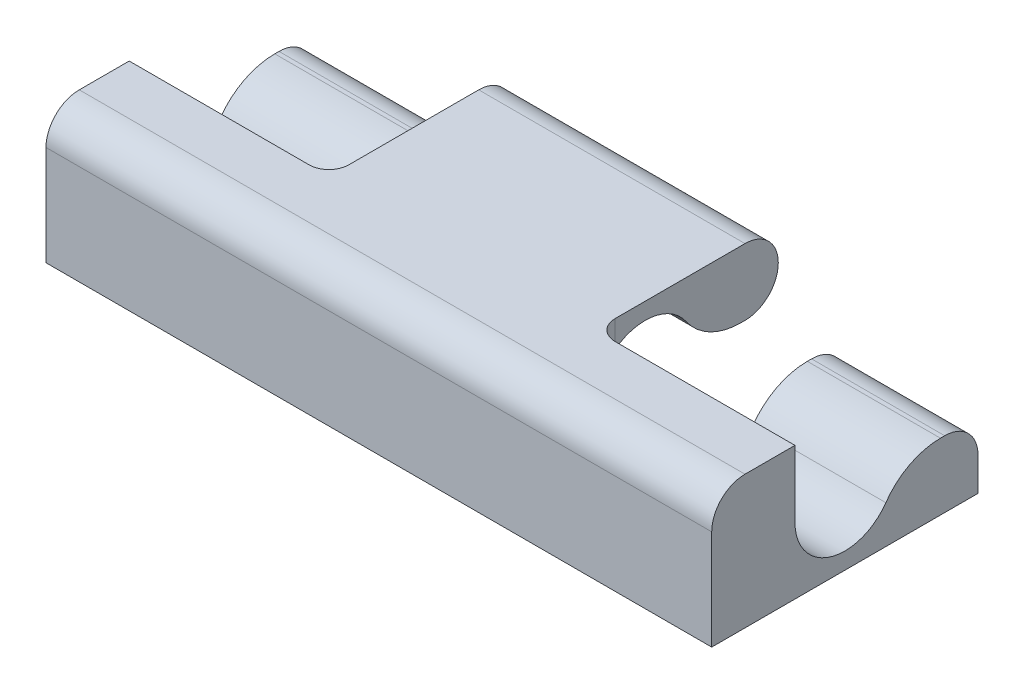
ISO-10303-21;
HEADER;
FILE_DESCRIPTION(('STEP AP214'),'2;1');
FILE_NAME('part.step','',(''),(''),'','','');
FILE_SCHEMA(('AUTOMOTIVE_DESIGN { 1 0 10303 214 1 1 1 1 }'));
ENDSEC;
DATA;
#1=APPLICATION_CONTEXT('core data for automotive mechanical design processes');
#2=APPLICATION_PROTOCOL_DEFINITION('international standard','automotive_design',2000,#1);
#3=PRODUCT_CONTEXT('',#1,'mechanical');
#4=PRODUCT('Part','Part','',(#3));
#5=PRODUCT_RELATED_PRODUCT_CATEGORY('part','',(#4));
#6=PRODUCT_DEFINITION_FORMATION('','',#4);
#7=PRODUCT_DEFINITION_CONTEXT('part definition',#1,'design');
#8=PRODUCT_DEFINITION('design','',#6,#7);
#9=PRODUCT_DEFINITION_SHAPE('','',#8);
#10=(LENGTH_UNIT() NAMED_UNIT(*) SI_UNIT(.MILLI.,.METRE.));
#11=(NAMED_UNIT(*) PLANE_ANGLE_UNIT() SI_UNIT($,.RADIAN.));
#12=(NAMED_UNIT(*) SI_UNIT($,.STERADIAN.) SOLID_ANGLE_UNIT());
#13=UNCERTAINTY_MEASURE_WITH_UNIT(LENGTH_MEASURE(1.E-05),#10,'distance_accuracy_value','');
#14=(GEOMETRIC_REPRESENTATION_CONTEXT(3) GLOBAL_UNCERTAINTY_ASSIGNED_CONTEXT((#13)) GLOBAL_UNIT_ASSIGNED_CONTEXT((#10,
#11,#12)) REPRESENTATION_CONTEXT('',''));
#15=CARTESIAN_POINT('',(0.,0.,0.));
#16=DIRECTION('',(0.,0.,1.));
#17=DIRECTION('',(1.,0.,0.));
#18=AXIS2_PLACEMENT_3D('',#15,#16,#17);
#19=CARTESIAN_POINT('',(-5.,2.,-2.));
#20=DIRECTION('',(0.,0.,1.));
#21=DIRECTION('',(1.,0.,0.));
#22=AXIS2_PLACEMENT_3D('',#19,#20,#21);
#23=PLANE('',#22);
#24=DIRECTION('',(0.,-1.,0.));
#25=VECTOR('',#24,1.);
#26=CARTESIAN_POINT('',(3.,1.,-2.));
#27=LINE('',#26,#25);
#28=CARTESIAN_POINT('',(3.,0.5,-2.));
#29=VERTEX_POINT('',#28);
#30=CARTESIAN_POINT('',(3.,0.,-2.));
#31=VERTEX_POINT('',#30);
#32=EDGE_CURVE('E242',#29,#31,#27,.T.);
#33=ORIENTED_EDGE('',*,*,#32,.F.);
#34=DIRECTION('',(1.,0.,0.));
#35=VECTOR('',#34,1.);
#36=CARTESIAN_POINT('',(5.,0.5,-2.));
#37=LINE('',#36,#35);
#38=CARTESIAN_POINT('',(5.,0.5,-2.));
#39=VERTEX_POINT('',#38);
#40=EDGE_CURVE('E333',#29,#39,#37,.T.);
#41=ORIENTED_EDGE('',*,*,#40,.T.);
#42=DIRECTION('',(0.,-1.,0.));
#43=VECTOR('',#42,1.);
#44=CARTESIAN_POINT('',(5.,2.,-2.));
#45=LINE('',#44,#43);
#46=CARTESIAN_POINT('',(5.,0.,-2.));
#47=VERTEX_POINT('',#46);
#48=EDGE_CURVE('E253',#39,#47,#45,.T.);
#49=ORIENTED_EDGE('',*,*,#48,.T.);
#50=DIRECTION('',(-1.,0.,0.));
#51=VECTOR('',#50,1.);
#52=CARTESIAN_POINT('',(-5.,0.,-2.));
#53=LINE('',#52,#51);
#54=EDGE_CURVE('E234',#47,#31,#53,.T.);
#55=ORIENTED_EDGE('',*,*,#54,.T.);
#56=EDGE_LOOP('',(#33,#41,#49,#55));
#57=FACE_BOUND('',#56,.T.);
#58=ADVANCED_FACE('F39',(#57),#23,.F.);
#59=CARTESIAN_POINT('',(-5.,1.,0.));
#60=DIRECTION('',(1.,0.,0.));
#61=DIRECTION('',(0.,0.,-1.));
#62=AXIS2_PLACEMENT_3D('',#59,#60,#61);
#63=CYLINDRICAL_SURFACE('',#62,0.75);
#64=CARTESIAN_POINT('',(5.,1.,0.));
#65=DIRECTION('',(1.,0.,0.));
#66=DIRECTION('',(0.,0.,-1.));
#67=AXIS2_PLACEMENT_3D('',#64,#65,#66);
#68=CIRCLE('',#67,0.75);
#69=CARTESIAN_POINT('',(5.,1.,0.75));
#70=VERTEX_POINT('',#69);
#71=CARTESIAN_POINT('',(5.,0.571428571428571,-0.615488854986217));
#72=VERTEX_POINT('',#71);
#73=EDGE_CURVE('E469',#70,#72,#68,.T.);
#74=ORIENTED_EDGE('',*,*,#73,.T.);
#75=DIRECTION('',(1.,0.,0.));
#76=VECTOR('',#75,1.);
#77=CARTESIAN_POINT('',(-5.,0.571428571428571,-0.615488854986217));
#78=LINE('',#77,#76);
#79=CARTESIAN_POINT('',(3.,0.571428571428571,-0.615488854986217));
#80=VERTEX_POINT('',#79);
#81=EDGE_CURVE('E286',#72,#80,#78,.F.);
#82=ORIENTED_EDGE('',*,*,#81,.T.);
#83=CARTESIAN_POINT('',(3.,1.,0.));
#84=DIRECTION('',(-1.,0.,0.));
#85=DIRECTION('',(0.,0.,1.));
#86=AXIS2_PLACEMENT_3D('',#83,#84,#85);
#87=CIRCLE('',#86,0.75);
#88=CARTESIAN_POINT('',(3.,0.4,0.45));
#89=VERTEX_POINT('',#88);
#90=EDGE_CURVE('E250',#89,#80,#87,.F.);
#91=ORIENTED_EDGE('',*,*,#90,.F.);
#92=CARTESIAN_POINT('',(3.,0.4,0.45));
#93=CARTESIAN_POINT('',(2.99997262729227,0.415400838970544,0.470566198593992));
#94=CARTESIAN_POINT('',(2.99789368128157,0.431801283443696,0.490203548205869));
#95=CARTESIAN_POINT('',(2.9905031921409,0.46599976354669,0.527223445056916));
#96=CARTESIAN_POINT('',(2.98522346314262,0.483782561804652,0.544626166258837));
#97=CARTESIAN_POINT('',(2.9695198169331,0.52824552451033,0.584099958552162));
#98=CARTESIAN_POINT('',(2.95786367703915,0.55549887426865,0.605017940066812));
#99=CARTESIAN_POINT('',(2.93127177192084,0.611567334086324,0.642468076499725));
#100=CARTESIAN_POINT('',(2.91631625821129,0.640391025867121,0.658972438315843));
#101=CARTESIAN_POINT('',(2.8776391465046,0.711103545013767,0.693663597238162));
#102=CARTESIAN_POINT('',(2.85285345884834,0.753455839141204,0.709712337769876));
#103=CARTESIAN_POINT('',(2.80119639126281,0.838952049801298,0.733848770930344));
#104=CARTESIAN_POINT('',(2.7743289344353,0.882094365702027,0.741951063046654));
#105=CARTESIAN_POINT('',(2.73245616199967,0.948673183701794,0.748607475183877));
#106=CARTESIAN_POINT('',(2.7176937478148,0.972023163843168,0.749841628501407));
#107=CARTESIAN_POINT('',(2.70195179690878,0.996913940171442,0.74999523670115));
#108=CARTESIAN_POINT('',(2.70097589260082,0.998456980444259,0.749999998023933));
#109=CARTESIAN_POINT('',(2.7,1.,0.75));
#110=B_SPLINE_CURVE_WITH_KNOTS('',3,(#92,#93,#94,#95,#96,#97,#98,#99,#100,#101,#102,#103,#104,
#105,#106,#107,#108,#109),.UNSPECIFIED.,.F.,.F.,(4,2,2,2,2,2,2,2,4),(0.,0.0767549314030123,
0.152759188227353,0.261018447018344,0.369944178687922,0.524017878449633,0.677807975480503,
0.760683571439132,0.766160815644707),.UNSPECIFIED.);
#111=CARTESIAN_POINT('',(2.7,1.,0.75));
#112=VERTEX_POINT('',#111);
#113=EDGE_CURVE('E379',#89,#112,#110,.T.);
#114=ORIENTED_EDGE('',*,*,#113,.T.);
#115=DIRECTION('',(1.,0.,0.));
#116=VECTOR('',#115,1.);
#117=CARTESIAN_POINT('',(2.,1.,0.75));
#118=LINE('',#117,#116);
#119=EDGE_CURVE('E454',#112,#70,#118,.T.);
#120=ORIENTED_EDGE('',*,*,#119,.T.);
#121=EDGE_LOOP('',(#74,#82,#91,#114,#120));
#122=FACE_BOUND('',#121,.T.);
#123=ADVANCED_FACE('F520',(#122),#63,.F.);
#124=CARTESIAN_POINT('',(0.,0.,0.));
#125=DIRECTION('',(0.,-1.,0.));
#126=DIRECTION('',(0.,0.,-1.));
#127=AXIS2_PLACEMENT_3D('',#124,#125,#126);
#128=PLANE('',#127);
#129=DIRECTION('',(-1.,0.,0.));
#130=VECTOR('',#129,1.);
#131=CARTESIAN_POINT('',(-3.,0.,0.750000000000001));
#132=LINE('',#131,#130);
#133=CARTESIAN_POINT('',(2.7,0.,0.750000000000001));
#134=VERTEX_POINT('',#133);
#135=CARTESIAN_POINT('',(-2.7,0.,0.750000000000001));
#136=VERTEX_POINT('',#135);
#137=EDGE_CURVE('E423',#134,#136,#132,.T.);
#138=ORIENTED_EDGE('',*,*,#137,.F.);
#139=CARTESIAN_POINT('',(2.7,0.,0.45));
#140=DIRECTION('',(0.,-1.,0.));
#141=DIRECTION('',(0.,0.,-1.));
#142=AXIS2_PLACEMENT_3D('',#139,#140,#141);
#143=CIRCLE('',#142,0.3);
#144=CARTESIAN_POINT('',(3.,0.,0.45));
#145=VERTEX_POINT('',#144);
#146=EDGE_CURVE('E236',#134,#145,#143,.F.);
#147=ORIENTED_EDGE('',*,*,#146,.T.);
#148=DIRECTION('',(0.,0.,-1.));
#149=VECTOR('',#148,1.);
#150=CARTESIAN_POINT('',(3.,0.,-2.));
#151=LINE('',#150,#149);
#152=EDGE_CURVE('E228',#145,#31,#151,.T.);
#153=ORIENTED_EDGE('',*,*,#152,.T.);
#154=ORIENTED_EDGE('',*,*,#54,.F.);
#155=DIRECTION('',(0.,0.,-1.));
#156=VECTOR('',#155,1.);
#157=CARTESIAN_POINT('',(5.,0.,2.));
#158=LINE('',#157,#156);
#159=CARTESIAN_POINT('',(5.,0.,2.));
#160=VERTEX_POINT('',#159);
#161=EDGE_CURVE('E261',#160,#47,#158,.T.);
#162=ORIENTED_EDGE('',*,*,#161,.F.);
#163=DIRECTION('',(1.,0.,0.));
#164=VECTOR('',#163,1.);
#165=CARTESIAN_POINT('',(-5.,0.,2.));
#166=LINE('',#165,#164);
#167=CARTESIAN_POINT('',(-5.,0.,2.));
#168=VERTEX_POINT('',#167);
#169=EDGE_CURVE('E258',#168,#160,#166,.T.);
#170=ORIENTED_EDGE('',*,*,#169,.F.);
#171=DIRECTION('',(0.,0.,1.));
#172=VECTOR('',#171,1.);
#173=CARTESIAN_POINT('',(-5.,0.,2.));
#174=LINE('',#173,#172);
#175=CARTESIAN_POINT('',(-5.,0.,-2.));
#176=VERTEX_POINT('',#175);
#177=EDGE_CURVE('E254',#176,#168,#174,.T.);
#178=ORIENTED_EDGE('',*,*,#177,.F.);
#179=CARTESIAN_POINT('',(-3.,0.,-2.));
#180=VERTEX_POINT('',#179);
#181=EDGE_CURVE('E255',#180,#176,#53,.T.);
#182=ORIENTED_EDGE('',*,*,#181,.F.);
#183=DIRECTION('',(0.,0.,-1.));
#184=VECTOR('',#183,1.);
#185=CARTESIAN_POINT('',(-3.,0.,-2.));
#186=LINE('',#185,#184);
#187=CARTESIAN_POINT('',(-3.,0.,0.45));
#188=VERTEX_POINT('',#187);
#189=EDGE_CURVE('E425',#188,#180,#186,.T.);
#190=ORIENTED_EDGE('',*,*,#189,.F.);
#191=CARTESIAN_POINT('',(-2.7,0.,0.45));
#192=DIRECTION('',(0.,-1.,0.));
#193=DIRECTION('',(0.,0.,-1.));
#194=AXIS2_PLACEMENT_3D('',#191,#192,#193);
#195=CIRCLE('',#194,0.3);
#196=EDGE_CURVE('E53',#188,#136,#195,.F.);
#197=ORIENTED_EDGE('',*,*,#196,.T.);
#198=EDGE_LOOP('',(#138,#147,#153,#154,#162,#170,#178,#182,#190,#197));
#199=FACE_BOUND('',#198,.T.);
#200=ADVANCED_FACE('F231',(#199),#128,.T.);
#201=CARTESIAN_POINT('',(2.,1.,-2.));
#202=DIRECTION('',(0.,1.,0.));
#203=DIRECTION('',(0.,0.,1.));
#204=AXIS2_PLACEMENT_3D('',#201,#202,#203);
#205=PLANE('',#204);
#206=DIRECTION('',(0.,0.,1.));
#207=VECTOR('',#206,1.);
#208=CARTESIAN_POINT('',(5.,1.,-2.));
#209=LINE('',#208,#207);
#210=CARTESIAN_POINT('',(5.,1.,-1.5));
#211=VERTEX_POINT('',#210);
#212=CARTESIAN_POINT('',(5.,1.,-1.43614066163451));
#213=VERTEX_POINT('',#212);
#214=EDGE_CURVE('E442',#211,#213,#209,.T.);
#215=ORIENTED_EDGE('',*,*,#214,.F.);
#216=DIRECTION('',(1.,0.,0.));
#217=VECTOR('',#216,1.);
#218=CARTESIAN_POINT('',(3.,1.,-1.5));
#219=LINE('',#218,#217);
#220=CARTESIAN_POINT('',(3.,1.,-1.5));
#221=VERTEX_POINT('',#220);
#222=EDGE_CURVE('E337',#211,#221,#219,.F.);
#223=ORIENTED_EDGE('',*,*,#222,.T.);
#224=DIRECTION('',(0.,0.,-1.));
#225=VECTOR('',#224,1.);
#226=CARTESIAN_POINT('',(3.,1.,-2.));
#227=LINE('',#226,#225);
#228=CARTESIAN_POINT('',(3.,1.,-1.43614066163451));
#229=VERTEX_POINT('',#228);
#230=EDGE_CURVE('E239',#229,#221,#227,.T.);
#231=ORIENTED_EDGE('',*,*,#230,.F.);
#232=DIRECTION('',(-1.,0.,0.));
#233=VECTOR('',#232,1.);
#234=CARTESIAN_POINT('',(5.,1.,-1.43614066163451));
#235=LINE('',#234,#233);
#236=EDGE_CURVE('E281',#229,#213,#235,.F.);
#237=ORIENTED_EDGE('',*,*,#236,.T.);
#238=EDGE_LOOP('',(#215,#223,#231,#237));
#239=FACE_BOUND('',#238,.T.);
#240=ADVANCED_FACE('F503',(#239),#205,.T.);
#241=DIRECTION('',(0.,-1.,0.));
#242=VECTOR('',#241,1.);
#243=CARTESIAN_POINT('',(-5.,2.,-2.));
#244=LINE('',#243,#242);
#245=CARTESIAN_POINT('',(-5.,0.5,-2.));
#246=VERTEX_POINT('',#245);
#247=EDGE_CURVE('E273',#246,#176,#244,.T.);
#248=ORIENTED_EDGE('',*,*,#247,.F.);
#249=DIRECTION('',(-1.,0.,0.));
#250=VECTOR('',#249,1.);
#251=CARTESIAN_POINT('',(-5.,0.5,-2.));
#252=LINE('',#251,#250);
#253=CARTESIAN_POINT('',(-3.,0.5,-2.));
#254=VERTEX_POINT('',#253);
#255=EDGE_CURVE('E319',#246,#254,#252,.F.);
#256=ORIENTED_EDGE('',*,*,#255,.T.);
#257=DIRECTION('',(0.,-1.,0.));
#258=VECTOR('',#257,1.);
#259=CARTESIAN_POINT('',(-3.,1.,-2.));
#260=LINE('',#259,#258);
#261=EDGE_CURVE('E439',#254,#180,#260,.T.);
#262=ORIENTED_EDGE('',*,*,#261,.T.);
#263=ORIENTED_EDGE('',*,*,#181,.T.);
#264=EDGE_LOOP('',(#248,#256,#262,#263));
#265=FACE_BOUND('',#264,.T.);
#266=ADVANCED_FACE('F522',(#265),#23,.F.);
#267=DIRECTION('',(-1.,0.,0.));
#268=VECTOR('',#267,1.);
#269=CARTESIAN_POINT('',(-2.,1.,0.75));
#270=LINE('',#269,#268);
#271=CARTESIAN_POINT('',(-2.7,1.,0.75));
#272=VERTEX_POINT('',#271);
#273=CARTESIAN_POINT('',(-5.,1.,0.75));
#274=VERTEX_POINT('',#273);
#275=EDGE_CURVE('E463',#272,#274,#270,.T.);
#276=ORIENTED_EDGE('',*,*,#275,.F.);
#277=CARTESIAN_POINT('',(-3.,0.4,0.45));
#278=CARTESIAN_POINT('',(-2.99997262729227,0.415400838970544,0.470566198593992));
#279=CARTESIAN_POINT('',(-2.99789368128157,0.431801283443697,0.490203548205869));
#280=CARTESIAN_POINT('',(-2.9905031921409,0.46599976354669,0.527223445056917));
#281=CARTESIAN_POINT('',(-2.98522346314262,0.483782561804652,0.544626166258837));
#282=CARTESIAN_POINT('',(-2.9695198169331,0.528245524510329,0.584099958552162));
#283=CARTESIAN_POINT('',(-2.95786367703915,0.555498874268648,0.605017940066811));
#284=CARTESIAN_POINT('',(-2.93127177192084,0.611567334086324,0.642468076499725));
#285=CARTESIAN_POINT('',(-2.91631625821129,0.640391025867122,0.658972438315843));
#286=CARTESIAN_POINT('',(-2.8776391465046,0.711103545013765,0.693663597238162));
#287=CARTESIAN_POINT('',(-2.85285345884833,0.753455839141196,0.709712337769876));
#288=CARTESIAN_POINT('',(-2.80119639126282,0.838952049801305,0.733848770930344));
#289=CARTESIAN_POINT('',(-2.77432893443534,0.882094365702053,0.741951063046654));
#290=CARTESIAN_POINT('',(-2.73245616199964,0.948673183701779,0.748607475183877));
#291=CARTESIAN_POINT('',(-2.71769374781473,0.972023163843125,0.749841628501407));
#292=CARTESIAN_POINT('',(-2.70195179690877,0.996913940171437,0.74999523670115));
#293=CARTESIAN_POINT('',(-2.70097589260082,0.998456980444256,0.749999998023933));
#294=CARTESIAN_POINT('',(-2.7,1.,0.75));
#295=B_SPLINE_CURVE_WITH_KNOTS('',3,(#277,#278,#279,#280,#281,#282,#283,#284,#285,#286,#287,
#288,#289,#290,#291,#292,#293,#294),.UNSPECIFIED.,.F.,.F.,(4,2,2,2,2,2,2,2,4),(0.,
0.0767549314030136,0.152759188227353,0.261018447018343,0.369944178687922,0.524017878449634,
0.677807975480502,0.760683571439133,0.766160815644707),.UNSPECIFIED.);
#296=CARTESIAN_POINT('',(-3.,0.4,0.45));
#297=VERTEX_POINT('',#296);
#298=EDGE_CURVE('E11',#272,#297,#295,.F.);
#299=ORIENTED_EDGE('',*,*,#298,.T.);
#300=CARTESIAN_POINT('',(-3.,1.,0.));
#301=DIRECTION('',(-1.,0.,0.));
#302=DIRECTION('',(0.,0.,1.));
#303=AXIS2_PLACEMENT_3D('',#300,#301,#302);
#304=CIRCLE('',#303,0.75);
#305=CARTESIAN_POINT('',(-3.,0.571428571428571,-0.615488854986217));
#306=VERTEX_POINT('',#305);
#307=EDGE_CURVE('E434',#297,#306,#304,.F.);
#308=ORIENTED_EDGE('',*,*,#307,.T.);
#309=DIRECTION('',(1.,0.,0.));
#310=VECTOR('',#309,1.);
#311=CARTESIAN_POINT('',(-5.,0.571428571428571,-0.615488854986217));
#312=LINE('',#311,#310);
#313=CARTESIAN_POINT('',(-5.,0.571428571428571,-0.615488854986217));
#314=VERTEX_POINT('',#313);
#315=EDGE_CURVE('E303',#306,#314,#312,.F.);
#316=ORIENTED_EDGE('',*,*,#315,.T.);
#317=CARTESIAN_POINT('',(-5.,1.,0.));
#318=DIRECTION('',(1.,0.,0.));
#319=DIRECTION('',(0.,0.,-1.));
#320=AXIS2_PLACEMENT_3D('',#317,#318,#319);
#321=CIRCLE('',#320,0.75);
#322=EDGE_CURVE('E471',#274,#314,#321,.T.);
#323=ORIENTED_EDGE('',*,*,#322,.F.);
#324=EDGE_LOOP('',(#276,#299,#308,#316,#323));
#325=FACE_BOUND('',#324,.T.);
#326=ADVANCED_FACE('F527',(#325),#63,.F.);
#327=CARTESIAN_POINT('',(5.,2.,2.));
#328=DIRECTION('',(-1.,0.,0.));
#329=DIRECTION('',(0.,0.,1.));
#330=AXIS2_PLACEMENT_3D('',#327,#328,#329);
#331=PLANE('',#330);
#332=DIRECTION('',(0.,0.,-1.));
#333=VECTOR('',#332,1.);
#334=CARTESIAN_POINT('',(5.,2.,2.));
#335=LINE('',#334,#333);
#336=CARTESIAN_POINT('',(5.,2.,1.5));
#337=VERTEX_POINT('',#336);
#338=CARTESIAN_POINT('',(5.,2.,0.75));
#339=VERTEX_POINT('',#338);
#340=EDGE_CURVE('E267',#337,#339,#335,.T.);
#341=ORIENTED_EDGE('',*,*,#340,.F.);
#342=CARTESIAN_POINT('',(5.,1.5,1.5));
#343=DIRECTION('',(-1.,0.,0.));
#344=DIRECTION('',(0.,0.,1.));
#345=AXIS2_PLACEMENT_3D('',#342,#343,#344);
#346=CIRCLE('',#345,0.5);
#347=CARTESIAN_POINT('',(5.,1.5,2.));
#348=VERTEX_POINT('',#347);
#349=EDGE_CURVE('E351',#337,#348,#346,.F.);
#350=ORIENTED_EDGE('',*,*,#349,.T.);
#351=DIRECTION('',(0.,-1.,0.));
#352=VECTOR('',#351,1.);
#353=CARTESIAN_POINT('',(5.,2.,2.));
#354=LINE('',#353,#352);
#355=EDGE_CURVE('E268',#348,#160,#354,.T.);
#356=ORIENTED_EDGE('',*,*,#355,.T.);
#357=ORIENTED_EDGE('',*,*,#161,.T.);
#358=ORIENTED_EDGE('',*,*,#48,.F.);
#359=CARTESIAN_POINT('',(5.,0.5,-1.5));
#360=DIRECTION('',(-1.,0.,0.));
#361=DIRECTION('',(0.,0.,1.));
#362=AXIS2_PLACEMENT_3D('',#359,#360,#361);
#363=CIRCLE('',#362,0.5);
#364=EDGE_CURVE('E335',#39,#211,#363,.F.);
#365=ORIENTED_EDGE('',*,*,#364,.T.);
#366=ORIENTED_EDGE('',*,*,#214,.T.);
#367=CARTESIAN_POINT('',(5.,0.,-1.43614066163451));
#368=DIRECTION('',(-1.,0.,0.));
#369=DIRECTION('',(0.,0.,1.));
#370=AXIS2_PLACEMENT_3D('',#367,#368,#369);
#371=CIRCLE('',#370,1.);
#372=EDGE_CURVE('E284',#213,#72,#371,.F.);
#373=ORIENTED_EDGE('',*,*,#372,.T.);
#374=ORIENTED_EDGE('',*,*,#73,.F.);
#375=DIRECTION('',(0.,1.,0.));
#376=VECTOR('',#375,1.);
#377=CARTESIAN_POINT('',(5.,1.,0.75));
#378=LINE('',#377,#376);
#379=EDGE_CURVE('E438',#70,#339,#378,.T.);
#380=ORIENTED_EDGE('',*,*,#379,.T.);
#381=EDGE_LOOP('',(#341,#350,#356,#357,#358,#365,#366,#373,#374,#380));
#382=FACE_BOUND('',#381,.T.);
#383=ADVANCED_FACE('F492',(#382),#331,.F.);
#384=CARTESIAN_POINT('',(0.,2.,0.));
#385=DIRECTION('',(0.,-1.,0.));
#386=DIRECTION('',(0.,0.,-1.));
#387=AXIS2_PLACEMENT_3D('',#384,#385,#386);
#388=PLANE('',#387);
#389=DIRECTION('',(1.,0.,0.));
#390=VECTOR('',#389,1.);
#391=CARTESIAN_POINT('',(2.,2.,0.75));
#392=LINE('',#391,#390);
#393=CARTESIAN_POINT('',(2.3,2.,0.75));
#394=VERTEX_POINT('',#393);
#395=EDGE_CURVE('E451',#394,#339,#392,.T.);
#396=ORIENTED_EDGE('',*,*,#395,.F.);
#397=CARTESIAN_POINT('',(2.3,2.,0.45));
#398=DIRECTION('',(0.,-1.,0.));
#399=DIRECTION('',(0.,0.,-1.));
#400=AXIS2_PLACEMENT_3D('',#397,#398,#399);
#401=CIRCLE('',#400,0.3);
#402=CARTESIAN_POINT('',(2.,2.,0.45));
#403=VERTEX_POINT('',#402);
#404=EDGE_CURVE('E387',#394,#403,#401,.T.);
#405=ORIENTED_EDGE('',*,*,#404,.T.);
#406=DIRECTION('',(0.,0.,-1.));
#407=VECTOR('',#406,1.);
#408=CARTESIAN_POINT('',(2.,2.,0.75));
#409=LINE('',#408,#407);
#410=CARTESIAN_POINT('',(2.,2.,-1.5));
#411=VERTEX_POINT('',#410);
#412=EDGE_CURVE('E448',#403,#411,#409,.T.);
#413=ORIENTED_EDGE('',*,*,#412,.T.);
#414=DIRECTION('',(-1.,0.,0.));
#415=VECTOR('',#414,1.);
#416=CARTESIAN_POINT('',(0.,2.,-1.5));
#417=LINE('',#416,#415);
#418=CARTESIAN_POINT('',(-2.,2.,-1.5));
#419=VERTEX_POINT('',#418);
#420=EDGE_CURVE('E343',#411,#419,#417,.T.);
#421=ORIENTED_EDGE('',*,*,#420,.T.);
#422=DIRECTION('',(0.,0.,-1.));
#423=VECTOR('',#422,1.);
#424=CARTESIAN_POINT('',(-2.,2.,0.75));
#425=LINE('',#424,#423);
#426=CARTESIAN_POINT('',(-2.,2.,0.45));
#427=VERTEX_POINT('',#426);
#428=EDGE_CURVE('E458',#427,#419,#425,.T.);
#429=ORIENTED_EDGE('',*,*,#428,.F.);
#430=CARTESIAN_POINT('',(-2.3,2.,0.45));
#431=DIRECTION('',(0.,-1.,0.));
#432=DIRECTION('',(0.,0.,-1.));
#433=AXIS2_PLACEMENT_3D('',#430,#431,#432);
#434=CIRCLE('',#433,0.3);
#435=CARTESIAN_POINT('',(-2.3,2.,0.75));
#436=VERTEX_POINT('',#435);
#437=EDGE_CURVE('E414',#427,#436,#434,.T.);
#438=ORIENTED_EDGE('',*,*,#437,.T.);
#439=DIRECTION('',(-1.,0.,0.));
#440=VECTOR('',#439,1.);
#441=CARTESIAN_POINT('',(-2.,2.,0.75));
#442=LINE('',#441,#440);
#443=CARTESIAN_POINT('',(-5.,2.,0.75));
#444=VERTEX_POINT('',#443);
#445=EDGE_CURVE('E467',#436,#444,#442,.T.);
#446=ORIENTED_EDGE('',*,*,#445,.T.);
#447=DIRECTION('',(0.,0.,1.));
#448=VECTOR('',#447,1.);
#449=CARTESIAN_POINT('',(-5.,2.,2.));
#450=LINE('',#449,#448);
#451=CARTESIAN_POINT('',(-5.,2.,1.5));
#452=VERTEX_POINT('',#451);
#453=EDGE_CURVE('E271',#444,#452,#450,.T.);
#454=ORIENTED_EDGE('',*,*,#453,.T.);
#455=DIRECTION('',(1.,0.,0.));
#456=VECTOR('',#455,1.);
#457=CARTESIAN_POINT('',(0.,2.,1.5));
#458=LINE('',#457,#456);
#459=EDGE_CURVE('E340',#452,#337,#458,.T.);
#460=ORIENTED_EDGE('',*,*,#459,.T.);
#461=ORIENTED_EDGE('',*,*,#340,.T.);
#462=EDGE_LOOP('',(#396,#405,#413,#421,#429,#438,#446,#454,#460,#461));
#463=FACE_BOUND('',#462,.T.);
#464=ADVANCED_FACE('F482',(#463),#388,.F.);
#465=DIRECTION('',(-1.,0.,0.));
#466=VECTOR('',#465,1.);
#467=CARTESIAN_POINT('',(-3.,1.,0.750000000000001));
#468=LINE('',#467,#466);
#469=CARTESIAN_POINT('',(2.3,1.,0.750000000000001));
#470=VERTEX_POINT('',#469);
#471=CARTESIAN_POINT('',(-2.3,1.,0.750000000000001));
#472=VERTEX_POINT('',#471);
#473=EDGE_CURVE('E547',#470,#472,#468,.T.);
#474=ORIENTED_EDGE('',*,*,#473,.T.);
#475=CARTESIAN_POINT('',(-2.,1.6,0.45));
#476=CARTESIAN_POINT('',(-2.00002737270773,1.58459916102946,0.470566198593992));
#477=CARTESIAN_POINT('',(-2.00210631871843,1.5681987165563,0.490203548205869));
#478=CARTESIAN_POINT('',(-2.0094968078591,1.53400023645331,0.527223445056917));
#479=CARTESIAN_POINT('',(-2.01477653685738,1.51621743819535,0.544626166258837));
#480=CARTESIAN_POINT('',(-2.0304801830669,1.47175447548967,0.584099958552162));
#481=CARTESIAN_POINT('',(-2.04213632296085,1.44450112573135,0.605017940066812));
#482=CARTESIAN_POINT('',(-2.06872822807916,1.38843266591368,0.642468076499725));
#483=CARTESIAN_POINT('',(-2.08368374178871,1.35960897413288,0.658972438315843));
#484=CARTESIAN_POINT('',(-2.1223608534954,1.28889645498623,0.693663597238162));
#485=CARTESIAN_POINT('',(-2.14714654115166,1.2465441608588,0.709712337769876));
#486=CARTESIAN_POINT('',(-2.19880360873719,1.1610479501987,0.733848770930344));
#487=CARTESIAN_POINT('',(-2.2256710655647,1.11790563429797,0.741951063046654));
#488=CARTESIAN_POINT('',(-2.26754383800033,1.05132681629821,0.748607475183877));
#489=CARTESIAN_POINT('',(-2.2823062521852,1.02797683615683,0.749841628501407));
#490=CARTESIAN_POINT('',(-2.29804820309122,1.00308605982856,0.74999523670115));
#491=CARTESIAN_POINT('',(-2.29902410739918,1.00154301955574,0.749999998023933));
#492=CARTESIAN_POINT('',(-2.3,1.,0.75));
#493=B_SPLINE_CURVE_WITH_KNOTS('',3,(#475,#476,#477,#478,#479,#480,#481,#482,#483,#484,#485,
#486,#487,#488,#489,#490,#491,#492),.UNSPECIFIED.,.F.,.F.,(4,2,2,2,2,2,2,2,4),(0.,
0.0767549314030122,0.152759188227353,0.261018447018344,0.369944178687922,0.524017878449633,
0.677807975480503,0.760683571439133,0.766160815644707),.UNSPECIFIED.);
#494=CARTESIAN_POINT('',(-2.,1.6,0.45));
#495=VERTEX_POINT('',#494);
#496=EDGE_CURVE('E416',#472,#495,#493,.F.);
#497=ORIENTED_EDGE('',*,*,#496,.T.);
#498=CARTESIAN_POINT('',(-2.,1.,0.));
#499=DIRECTION('',(1.,0.,0.));
#500=DIRECTION('',(0.,0.,-1.));
#501=AXIS2_PLACEMENT_3D('',#498,#499,#500);
#502=CIRCLE('',#501,0.75);
#503=CARTESIAN_POINT('',(-2.,1.42857142857143,-0.615488854986217));
#504=VERTEX_POINT('',#503);
#505=EDGE_CURVE('E276',#495,#504,#502,.F.);
#506=ORIENTED_EDGE('',*,*,#505,.T.);
#507=DIRECTION('',(1.,0.,0.));
#508=VECTOR('',#507,1.);
#509=CARTESIAN_POINT('',(-5.,1.42857142857143,-0.615488854986217));
#510=LINE('',#509,#508);
#511=CARTESIAN_POINT('',(2.,1.42857142857143,-0.615488854986217));
#512=VERTEX_POINT('',#511);
#513=EDGE_CURVE('E291',#504,#512,#510,.T.);
#514=ORIENTED_EDGE('',*,*,#513,.T.);
#515=CARTESIAN_POINT('',(2.,1.,0.));
#516=DIRECTION('',(-1.,0.,0.));
#517=DIRECTION('',(0.,0.,1.));
#518=AXIS2_PLACEMENT_3D('',#515,#516,#517);
#519=CIRCLE('',#518,0.75);
#520=CARTESIAN_POINT('',(2.,1.6,0.45));
#521=VERTEX_POINT('',#520);
#522=EDGE_CURVE('E278',#512,#521,#519,.F.);
#523=ORIENTED_EDGE('',*,*,#522,.T.);
#524=CARTESIAN_POINT('',(2.,1.6,0.45));
#525=CARTESIAN_POINT('',(2.00002737270773,1.58459916102946,0.470566198593992));
#526=CARTESIAN_POINT('',(2.00210631871843,1.5681987165563,0.490203548205869));
#527=CARTESIAN_POINT('',(2.0094968078591,1.53400023645331,0.527223445056917));
#528=CARTESIAN_POINT('',(2.01477653685738,1.51621743819535,0.544626166258837));
#529=CARTESIAN_POINT('',(2.0304801830669,1.47175447548967,0.584099958552162));
#530=CARTESIAN_POINT('',(2.04213632296085,1.44450112573135,0.605017940066812));
#531=CARTESIAN_POINT('',(2.06872822807916,1.38843266591368,0.642468076499725));
#532=CARTESIAN_POINT('',(2.08368374178871,1.35960897413288,0.658972438315843));
#533=CARTESIAN_POINT('',(2.1223608534954,1.28889645498623,0.693663597238162));
#534=CARTESIAN_POINT('',(2.14714654115166,1.2465441608588,0.709712337769876));
#535=CARTESIAN_POINT('',(2.19880360873719,1.1610479501987,0.733848770930344));
#536=CARTESIAN_POINT('',(2.2256710655647,1.11790563429797,0.741951063046654));
#537=CARTESIAN_POINT('',(2.26754383800033,1.05132681629821,0.748607475183877));
#538=CARTESIAN_POINT('',(2.2823062521852,1.02797683615683,0.749841628501407));
#539=CARTESIAN_POINT('',(2.29804820309122,1.00308605982856,0.74999523670115));
#540=CARTESIAN_POINT('',(2.29902410739918,1.00154301955574,0.749999998023933));
#541=CARTESIAN_POINT('',(2.3,1.,0.75));
#542=B_SPLINE_CURVE_WITH_KNOTS('',3,(#524,#525,#526,#527,#528,#529,#530,#531,#532,#533,#534,
#535,#536,#537,#538,#539,#540,#541),.UNSPECIFIED.,.F.,.F.,(4,2,2,2,2,2,2,2,4),(0.,
0.0767549314030122,0.152759188227353,0.261018447018344,0.369944178687922,0.524017878449633,
0.677807975480503,0.760683571439133,0.766160815644707),.UNSPECIFIED.);
#543=EDGE_CURVE('E407',#521,#470,#542,.T.);
#544=ORIENTED_EDGE('',*,*,#543,.T.);
#545=EDGE_LOOP('',(#474,#497,#506,#514,#523,#544));
#546=FACE_BOUND('',#545,.T.);
#547=ADVANCED_FACE('F389',(#546),#63,.F.);
#548=CARTESIAN_POINT('',(-5.,2.,2.));
#549=DIRECTION('',(1.,0.,0.));
#550=DIRECTION('',(0.,0.,-1.));
#551=AXIS2_PLACEMENT_3D('',#548,#549,#550);
#552=PLANE('',#551);
#553=DIRECTION('',(0.,-1.,0.));
#554=VECTOR('',#553,1.);
#555=CARTESIAN_POINT('',(-5.,2.,2.));
#556=LINE('',#555,#554);
#557=CARTESIAN_POINT('',(-5.,1.5,2.));
#558=VERTEX_POINT('',#557);
#559=EDGE_CURVE('E270',#558,#168,#556,.T.);
#560=ORIENTED_EDGE('',*,*,#559,.F.);
#561=CARTESIAN_POINT('',(-5.,1.5,1.5));
#562=DIRECTION('',(1.,0.,0.));
#563=DIRECTION('',(0.,0.,-1.));
#564=AXIS2_PLACEMENT_3D('',#561,#562,#563);
#565=CIRCLE('',#564,0.5);
#566=EDGE_CURVE('E355',#558,#452,#565,.F.);
#567=ORIENTED_EDGE('',*,*,#566,.T.);
#568=ORIENTED_EDGE('',*,*,#453,.F.);
#569=DIRECTION('',(0.,1.,0.));
#570=VECTOR('',#569,1.);
#571=CARTESIAN_POINT('',(-5.,1.,0.75));
#572=LINE('',#571,#570);
#573=EDGE_CURVE('E461',#274,#444,#572,.T.);
#574=ORIENTED_EDGE('',*,*,#573,.F.);
#575=ORIENTED_EDGE('',*,*,#322,.T.);
#576=CARTESIAN_POINT('',(-5.,0.,-1.43614066163451));
#577=DIRECTION('',(1.,0.,0.));
#578=DIRECTION('',(0.,0.,-1.));
#579=AXIS2_PLACEMENT_3D('',#576,#577,#578);
#580=CIRCLE('',#579,1.);
#581=CARTESIAN_POINT('',(-5.,1.,-1.43614066163451));
#582=VERTEX_POINT('',#581);
#583=EDGE_CURVE('E306',#314,#582,#580,.F.);
#584=ORIENTED_EDGE('',*,*,#583,.T.);
#585=DIRECTION('',(0.,0.,1.));
#586=VECTOR('',#585,1.);
#587=CARTESIAN_POINT('',(-5.,1.,-2.));
#588=LINE('',#587,#586);
#589=CARTESIAN_POINT('',(-5.,1.,-1.5));
#590=VERTEX_POINT('',#589);
#591=EDGE_CURVE('E456',#590,#582,#588,.T.);
#592=ORIENTED_EDGE('',*,*,#591,.F.);
#593=CARTESIAN_POINT('',(-5.,0.5,-1.5));
#594=DIRECTION('',(1.,0.,0.));
#595=DIRECTION('',(0.,0.,-1.));
#596=AXIS2_PLACEMENT_3D('',#593,#594,#595);
#597=CIRCLE('',#596,0.5);
#598=EDGE_CURVE('E317',#590,#246,#597,.F.);
#599=ORIENTED_EDGE('',*,*,#598,.T.);
#600=ORIENTED_EDGE('',*,*,#247,.T.);
#601=ORIENTED_EDGE('',*,*,#177,.T.);
#602=EDGE_LOOP('',(#560,#567,#568,#574,#575,#584,#592,#599,#600,#601));
#603=FACE_BOUND('',#602,.T.);
#604=ADVANCED_FACE('F592',(#603),#552,.F.);
#605=CARTESIAN_POINT('',(-5.,2.,2.));
#606=DIRECTION('',(0.,0.,-1.));
#607=DIRECTION('',(-1.,0.,0.));
#608=AXIS2_PLACEMENT_3D('',#605,#606,#607);
#609=PLANE('',#608);
#610=ORIENTED_EDGE('',*,*,#355,.F.);
#611=DIRECTION('',(1.,0.,0.));
#612=VECTOR('',#611,1.);
#613=CARTESIAN_POINT('',(-5.,1.5,2.));
#614=LINE('',#613,#612);
#615=EDGE_CURVE('E353',#348,#558,#614,.F.);
#616=ORIENTED_EDGE('',*,*,#615,.T.);
#617=ORIENTED_EDGE('',*,*,#559,.T.);
#618=ORIENTED_EDGE('',*,*,#169,.T.);
#619=EDGE_LOOP('',(#610,#616,#617,#618));
#620=FACE_BOUND('',#619,.T.);
#621=ADVANCED_FACE('F494',(#620),#609,.F.);
#622=CARTESIAN_POINT('',(-2.,1.,-2.));
#623=DIRECTION('',(0.,-1.,0.));
#624=DIRECTION('',(0.,0.,-1.));
#625=AXIS2_PLACEMENT_3D('',#622,#623,#624);
#626=PLANE('',#625);
#627=DIRECTION('',(0.,0.,-1.));
#628=VECTOR('',#627,1.);
#629=CARTESIAN_POINT('',(-3.,1.,-2.));
#630=LINE('',#629,#628);
#631=CARTESIAN_POINT('',(-3.,1.,-1.43614066163451));
#632=VERTEX_POINT('',#631);
#633=CARTESIAN_POINT('',(-3.,1.,-1.5));
#634=VERTEX_POINT('',#633);
#635=EDGE_CURVE('E444',#632,#634,#630,.T.);
#636=ORIENTED_EDGE('',*,*,#635,.T.);
#637=DIRECTION('',(-1.,0.,0.));
#638=VECTOR('',#637,1.);
#639=CARTESIAN_POINT('',(-2.,1.,-1.5));
#640=LINE('',#639,#638);
#641=EDGE_CURVE('E314',#634,#590,#640,.T.);
#642=ORIENTED_EDGE('',*,*,#641,.T.);
#643=ORIENTED_EDGE('',*,*,#591,.T.);
#644=DIRECTION('',(1.,0.,0.));
#645=VECTOR('',#644,1.);
#646=CARTESIAN_POINT('',(-2.,1.,-1.43614066163451));
#647=LINE('',#646,#645);
#648=EDGE_CURVE('E309',#582,#632,#647,.T.);
#649=ORIENTED_EDGE('',*,*,#648,.T.);
#650=EDGE_LOOP('',(#636,#642,#643,#649));
#651=FACE_BOUND('',#650,.T.);
#652=ADVANCED_FACE('F544',(#651),#626,.F.);
#653=CARTESIAN_POINT('',(-2.,0.,0.));
#654=DIRECTION('',(1.,0.,0.));
#655=DIRECTION('',(0.,0.,-1.));
#656=AXIS2_PLACEMENT_3D('',#653,#654,#655);
#657=PLANE('',#656);
#658=ORIENTED_EDGE('',*,*,#505,.F.);
#659=DIRECTION('',(0.,1.,0.));
#660=VECTOR('',#659,1.);
#661=CARTESIAN_POINT('',(-2.,2.,0.45));
#662=LINE('',#661,#660);
#663=EDGE_CURVE('E373',#495,#427,#662,.T.);
#664=ORIENTED_EDGE('',*,*,#663,.T.);
#665=ORIENTED_EDGE('',*,*,#428,.T.);
#666=CARTESIAN_POINT('',(-2.,1.5,-1.5));
#667=DIRECTION('',(1.,0.,0.));
#668=DIRECTION('',(0.,0.,-1.));
#669=AXIS2_PLACEMENT_3D('',#666,#667,#668);
#670=CIRCLE('',#669,0.5);
#671=CARTESIAN_POINT('',(-2.,1.5,-2.));
#672=VERTEX_POINT('',#671);
#673=EDGE_CURVE('E346',#419,#672,#670,.F.);
#674=ORIENTED_EDGE('',*,*,#673,.T.);
#675=CARTESIAN_POINT('',(-2.,1.5,-1.5));
#676=DIRECTION('',(1.,0.,0.));
#677=DIRECTION('',(0.,0.,-1.));
#678=AXIS2_PLACEMENT_3D('',#675,#676,#677);
#679=CIRCLE('',#678,0.5);
#680=CARTESIAN_POINT('',(-2.,1.,-1.5));
#681=VERTEX_POINT('',#680);
#682=EDGE_CURVE('E331',#672,#681,#679,.F.);
#683=ORIENTED_EDGE('',*,*,#682,.T.);
#684=DIRECTION('',(0.,0.,1.));
#685=VECTOR('',#684,1.);
#686=CARTESIAN_POINT('',(-2.,1.,-2.));
#687=LINE('',#686,#685);
#688=CARTESIAN_POINT('',(-2.,1.,-1.43614066163451));
#689=VERTEX_POINT('',#688);
#690=EDGE_CURVE('E460',#681,#689,#687,.T.);
#691=ORIENTED_EDGE('',*,*,#690,.T.);
#692=CARTESIAN_POINT('',(-2.,2.,-1.43614066163451));
#693=DIRECTION('',(1.,0.,0.));
#694=DIRECTION('',(0.,0.,-1.));
#695=AXIS2_PLACEMENT_3D('',#692,#693,#694);
#696=CIRCLE('',#695,1.);
#697=EDGE_CURVE('E300',#689,#504,#696,.F.);
#698=ORIENTED_EDGE('',*,*,#697,.T.);
#699=EDGE_LOOP('',(#658,#664,#665,#674,#683,#691,#698));
#700=FACE_BOUND('',#699,.T.);
#701=ADVANCED_FACE('F586',(#700),#657,.F.);
#702=CARTESIAN_POINT('',(-2.,1.,0.75));
#703=DIRECTION('',(0.,0.,1.));
#704=DIRECTION('',(0.,-1.,0.));
#705=AXIS2_PLACEMENT_3D('',#702,#703,#704);
#706=PLANE('',#705);
#707=ORIENTED_EDGE('',*,*,#119,.F.);
#708=DIRECTION('',(0.,-1.,0.));
#709=VECTOR('',#708,1.);
#710=CARTESIAN_POINT('',(2.7,1.,0.75));
#711=LINE('',#710,#709);
#712=EDGE_CURVE('E366',#112,#134,#711,.T.);
#713=ORIENTED_EDGE('',*,*,#712,.T.);
#714=ORIENTED_EDGE('',*,*,#137,.T.);
#715=DIRECTION('',(0.,-1.,0.));
#716=VECTOR('',#715,1.);
#717=CARTESIAN_POINT('',(-2.7,1.,0.75));
#718=LINE('',#717,#716);
#719=EDGE_CURVE('E357',#136,#272,#718,.F.);
#720=ORIENTED_EDGE('',*,*,#719,.T.);
#721=ORIENTED_EDGE('',*,*,#275,.T.);
#722=ORIENTED_EDGE('',*,*,#573,.T.);
#723=ORIENTED_EDGE('',*,*,#445,.F.);
#724=DIRECTION('',(0.,1.,0.));
#725=VECTOR('',#724,1.);
#726=CARTESIAN_POINT('',(-2.3,1.,0.75));
#727=LINE('',#726,#725);
#728=EDGE_CURVE('E360',#436,#472,#727,.F.);
#729=ORIENTED_EDGE('',*,*,#728,.T.);
#730=ORIENTED_EDGE('',*,*,#473,.F.);
#731=DIRECTION('',(0.,1.,0.));
#732=VECTOR('',#731,1.);
#733=CARTESIAN_POINT('',(2.3,2.,0.75));
#734=LINE('',#733,#732);
#735=EDGE_CURVE('E363',#470,#394,#734,.T.);
#736=ORIENTED_EDGE('',*,*,#735,.T.);
#737=ORIENTED_EDGE('',*,*,#395,.T.);
#738=ORIENTED_EDGE('',*,*,#379,.F.);
#739=EDGE_LOOP('',(#707,#713,#714,#720,#721,#722,#723,#729,#730,#736,#737,#738));
#740=FACE_BOUND('',#739,.T.);
#741=ADVANCED_FACE('F427',(#740),#706,.F.);
#742=CARTESIAN_POINT('',(2.,0.,0.));
#743=DIRECTION('',(-1.,0.,0.));
#744=DIRECTION('',(0.,0.,-1.));
#745=AXIS2_PLACEMENT_3D('',#742,#743,#744);
#746=PLANE('',#745);
#747=ORIENTED_EDGE('',*,*,#412,.F.);
#748=DIRECTION('',(0.,1.,0.));
#749=VECTOR('',#748,1.);
#750=CARTESIAN_POINT('',(2.,1.,0.45));
#751=LINE('',#750,#749);
#752=EDGE_CURVE('E371',#403,#521,#751,.F.);
#753=ORIENTED_EDGE('',*,*,#752,.T.);
#754=ORIENTED_EDGE('',*,*,#522,.F.);
#755=CARTESIAN_POINT('',(2.,2.,-1.43614066163451));
#756=DIRECTION('',(-1.,0.,0.));
#757=DIRECTION('',(0.,0.,1.));
#758=AXIS2_PLACEMENT_3D('',#755,#756,#757);
#759=CIRCLE('',#758,1.);
#760=CARTESIAN_POINT('',(2.,1.,-1.43614066163451));
#761=VERTEX_POINT('',#760);
#762=EDGE_CURVE('E294',#512,#761,#759,.F.);
#763=ORIENTED_EDGE('',*,*,#762,.T.);
#764=DIRECTION('',(0.,0.,1.));
#765=VECTOR('',#764,1.);
#766=CARTESIAN_POINT('',(2.,1.,-2.));
#767=LINE('',#766,#765);
#768=CARTESIAN_POINT('',(2.,1.,-1.5));
#769=VERTEX_POINT('',#768);
#770=EDGE_CURVE('E450',#769,#761,#767,.T.);
#771=ORIENTED_EDGE('',*,*,#770,.F.);
#772=CARTESIAN_POINT('',(2.,1.5,-1.5));
#773=DIRECTION('',(-1.,0.,0.));
#774=DIRECTION('',(0.,0.,1.));
#775=AXIS2_PLACEMENT_3D('',#772,#773,#774);
#776=CIRCLE('',#775,0.5);
#777=CARTESIAN_POINT('',(2.,1.5,-2.));
#778=VERTEX_POINT('',#777);
#779=EDGE_CURVE('E326',#769,#778,#776,.F.);
#780=ORIENTED_EDGE('',*,*,#779,.T.);
#781=CARTESIAN_POINT('',(2.,1.5,-1.5));
#782=DIRECTION('',(-1.,0.,0.));
#783=DIRECTION('',(0.,0.,1.));
#784=AXIS2_PLACEMENT_3D('',#781,#782,#783);
#785=CIRCLE('',#784,0.5);
#786=EDGE_CURVE('E348',#778,#411,#785,.F.);
#787=ORIENTED_EDGE('',*,*,#786,.T.);
#788=EDGE_LOOP('',(#747,#753,#754,#763,#771,#780,#787));
#789=FACE_BOUND('',#788,.T.);
#790=ADVANCED_FACE('F564',(#789),#746,.F.);
#791=CARTESIAN_POINT('',(-3.,1.,-2.));
#792=DIRECTION('',(-1.,0.,0.));
#793=DIRECTION('',(0.,0.,1.));
#794=AXIS2_PLACEMENT_3D('',#791,#792,#793);
#795=PLANE('',#794);
#796=ORIENTED_EDGE('',*,*,#307,.F.);
#797=DIRECTION('',(0.,-1.,0.));
#798=VECTOR('',#797,1.);
#799=CARTESIAN_POINT('',(-3.,0.,0.45));
#800=LINE('',#799,#798);
#801=EDGE_CURVE('E376',#297,#188,#800,.T.);
#802=ORIENTED_EDGE('',*,*,#801,.T.);
#803=ORIENTED_EDGE('',*,*,#189,.T.);
#804=ORIENTED_EDGE('',*,*,#261,.F.);
#805=CARTESIAN_POINT('',(-3.,0.5,-1.5));
#806=DIRECTION('',(-1.,0.,0.));
#807=DIRECTION('',(0.,0.,1.));
#808=AXIS2_PLACEMENT_3D('',#805,#806,#807);
#809=CIRCLE('',#808,0.5);
#810=EDGE_CURVE('E321',#254,#634,#809,.F.);
#811=ORIENTED_EDGE('',*,*,#810,.T.);
#812=ORIENTED_EDGE('',*,*,#635,.F.);
#813=CARTESIAN_POINT('',(-3.,0.,-1.43614066163451));
#814=DIRECTION('',(-1.,0.,0.));
#815=DIRECTION('',(0.,0.,1.));
#816=AXIS2_PLACEMENT_3D('',#813,#814,#815);
#817=CIRCLE('',#816,1.);
#818=EDGE_CURVE('E311',#632,#306,#817,.F.);
#819=ORIENTED_EDGE('',*,*,#818,.T.);
#820=EDGE_LOOP('',(#796,#802,#803,#804,#811,#812,#819));
#821=FACE_BOUND('',#820,.T.);
#822=ADVANCED_FACE('F431',(#821),#795,.F.);
#823=CARTESIAN_POINT('',(0.,1.,0.));
#824=DIRECTION('',(0.,1.,0.));
#825=DIRECTION('',(0.,0.,1.));
#826=AXIS2_PLACEMENT_3D('',#823,#824,#825);
#827=PLANE('',#826);
#828=ORIENTED_EDGE('',*,*,#690,.F.);
#829=DIRECTION('',(1.,0.,0.));
#830=VECTOR('',#829,1.);
#831=CARTESIAN_POINT('',(0.,1.,-1.5));
#832=LINE('',#831,#830);
#833=EDGE_CURVE('E323',#681,#769,#832,.T.);
#834=ORIENTED_EDGE('',*,*,#833,.T.);
#835=ORIENTED_EDGE('',*,*,#770,.T.);
#836=DIRECTION('',(1.,0.,0.));
#837=VECTOR('',#836,1.);
#838=CARTESIAN_POINT('',(0.,1.,-1.43614066163451));
#839=LINE('',#838,#837);
#840=EDGE_CURVE('E297',#761,#689,#839,.F.);
#841=ORIENTED_EDGE('',*,*,#840,.T.);
#842=EDGE_LOOP('',(#828,#834,#835,#841));
#843=FACE_BOUND('',#842,.T.);
#844=ADVANCED_FACE('F578',(#843),#827,.F.);
#845=CARTESIAN_POINT('',(3.,1.,-2.));
#846=DIRECTION('',(-1.,0.,0.));
#847=DIRECTION('',(0.,0.,1.));
#848=AXIS2_PLACEMENT_3D('',#845,#846,#847);
#849=PLANE('',#848);
#850=ORIENTED_EDGE('',*,*,#152,.F.);
#851=DIRECTION('',(0.,-1.,0.));
#852=VECTOR('',#851,1.);
#853=CARTESIAN_POINT('',(3.,1.,0.45));
#854=LINE('',#853,#852);
#855=EDGE_CURVE('E369',#145,#89,#854,.F.);
#856=ORIENTED_EDGE('',*,*,#855,.T.);
#857=ORIENTED_EDGE('',*,*,#90,.T.);
#858=CARTESIAN_POINT('',(3.,0.,-1.43614066163451));
#859=DIRECTION('',(-1.,0.,0.));
#860=DIRECTION('',(0.,0.,1.));
#861=AXIS2_PLACEMENT_3D('',#858,#859,#860);
#862=CIRCLE('',#861,1.);
#863=EDGE_CURVE('E289',#80,#229,#862,.T.);
#864=ORIENTED_EDGE('',*,*,#863,.T.);
#865=ORIENTED_EDGE('',*,*,#230,.T.);
#866=CARTESIAN_POINT('',(3.,0.5,-1.5));
#867=DIRECTION('',(-1.,0.,0.));
#868=DIRECTION('',(0.,0.,1.));
#869=AXIS2_PLACEMENT_3D('',#866,#867,#868);
#870=CIRCLE('',#869,0.5);
#871=EDGE_CURVE('E246',#221,#29,#870,.T.);
#872=ORIENTED_EDGE('',*,*,#871,.T.);
#873=ORIENTED_EDGE('',*,*,#32,.T.);
#874=EDGE_LOOP('',(#850,#856,#857,#864,#865,#872,#873));
#875=FACE_BOUND('',#874,.T.);
#876=ADVANCED_FACE('F243',(#875),#849,.T.);
#877=CARTESIAN_POINT('',(-5.,0.,-1.43614066163451));
#878=DIRECTION('',(1.,0.,0.));
#879=DIRECTION('',(0.,0.,-1.));
#880=AXIS2_PLACEMENT_3D('',#877,#878,#879);
#881=CYLINDRICAL_SURFACE('',#880,1.);
#882=ORIENTED_EDGE('',*,*,#863,.F.);
#883=ORIENTED_EDGE('',*,*,#81,.F.);
#884=ORIENTED_EDGE('',*,*,#372,.F.);
#885=ORIENTED_EDGE('',*,*,#236,.F.);
#886=EDGE_LOOP('',(#882,#883,#884,#885));
#887=FACE_BOUND('',#886,.T.);
#888=ADVANCED_FACE('F554',(#887),#881,.T.);
#889=CARTESIAN_POINT('',(-5.,2.,-1.43614066163451));
#890=DIRECTION('',(1.,0.,0.));
#891=DIRECTION('',(0.,0.,-1.));
#892=AXIS2_PLACEMENT_3D('',#889,#890,#891);
#893=CYLINDRICAL_SURFACE('',#892,1.);
#894=ORIENTED_EDGE('',*,*,#697,.F.);
#895=ORIENTED_EDGE('',*,*,#840,.F.);
#896=ORIENTED_EDGE('',*,*,#762,.F.);
#897=ORIENTED_EDGE('',*,*,#513,.F.);
#898=EDGE_LOOP('',(#894,#895,#896,#897));
#899=FACE_BOUND('',#898,.T.);
#900=ADVANCED_FACE('F575',(#899),#893,.T.);
#901=CARTESIAN_POINT('',(-5.,0.,-1.43614066163451));
#902=DIRECTION('',(1.,0.,0.));
#903=DIRECTION('',(0.,0.,-1.));
#904=AXIS2_PLACEMENT_3D('',#901,#902,#903);
#905=CYLINDRICAL_SURFACE('',#904,1.);
#906=ORIENTED_EDGE('',*,*,#818,.F.);
#907=ORIENTED_EDGE('',*,*,#648,.F.);
#908=ORIENTED_EDGE('',*,*,#583,.F.);
#909=ORIENTED_EDGE('',*,*,#315,.F.);
#910=EDGE_LOOP('',(#906,#907,#908,#909));
#911=FACE_BOUND('',#910,.T.);
#912=ADVANCED_FACE('F594',(#911),#905,.T.);
#913=CARTESIAN_POINT('',(-2.,0.5,-1.5));
#914=DIRECTION('',(-1.,0.,0.));
#915=DIRECTION('',(0.,0.,1.));
#916=AXIS2_PLACEMENT_3D('',#913,#914,#915);
#917=CYLINDRICAL_SURFACE('',#916,0.5);
#918=ORIENTED_EDGE('',*,*,#810,.F.);
#919=ORIENTED_EDGE('',*,*,#255,.F.);
#920=ORIENTED_EDGE('',*,*,#598,.F.);
#921=ORIENTED_EDGE('',*,*,#641,.F.);
#922=EDGE_LOOP('',(#918,#919,#920,#921));
#923=FACE_BOUND('',#922,.T.);
#924=ADVANCED_FACE('F516',(#923),#917,.T.);
#925=CARTESIAN_POINT('',(0.,1.5,-1.5));
#926=DIRECTION('',(1.,0.,0.));
#927=DIRECTION('',(0.,0.,-1.));
#928=AXIS2_PLACEMENT_3D('',#925,#926,#927);
#929=CYLINDRICAL_SURFACE('',#928,0.5);
#930=ORIENTED_EDGE('',*,*,#682,.F.);
#931=DIRECTION('',(1.,0.,0.));
#932=VECTOR('',#931,1.);
#933=CARTESIAN_POINT('',(-5.,1.5,-2.));
#934=LINE('',#933,#932);
#935=EDGE_CURVE('E328',#778,#672,#934,.F.);
#936=ORIENTED_EDGE('',*,*,#935,.F.);
#937=ORIENTED_EDGE('',*,*,#779,.F.);
#938=ORIENTED_EDGE('',*,*,#833,.F.);
#939=EDGE_LOOP('',(#930,#936,#937,#938));
#940=FACE_BOUND('',#939,.T.);
#941=ADVANCED_FACE('F509',(#940),#929,.T.);
#942=CARTESIAN_POINT('',(-5.,0.5,-1.5));
#943=DIRECTION('',(-1.,0.,0.));
#944=DIRECTION('',(0.,0.,1.));
#945=AXIS2_PLACEMENT_3D('',#942,#943,#944);
#946=CYLINDRICAL_SURFACE('',#945,0.5);
#947=ORIENTED_EDGE('',*,*,#871,.F.);
#948=ORIENTED_EDGE('',*,*,#222,.F.);
#949=ORIENTED_EDGE('',*,*,#364,.F.);
#950=ORIENTED_EDGE('',*,*,#40,.F.);
#951=EDGE_LOOP('',(#947,#948,#949,#950));
#952=FACE_BOUND('',#951,.T.);
#953=ADVANCED_FACE('F506',(#952),#946,.T.);
#954=CARTESIAN_POINT('',(0.,1.5,-1.5));
#955=DIRECTION('',(-1.,0.,0.));
#956=DIRECTION('',(0.,0.,1.));
#957=AXIS2_PLACEMENT_3D('',#954,#955,#956);
#958=CYLINDRICAL_SURFACE('',#957,0.5);
#959=ORIENTED_EDGE('',*,*,#786,.F.);
#960=ORIENTED_EDGE('',*,*,#935,.T.);
#961=ORIENTED_EDGE('',*,*,#673,.F.);
#962=ORIENTED_EDGE('',*,*,#420,.F.);
#963=EDGE_LOOP('',(#959,#960,#961,#962));
#964=FACE_BOUND('',#963,.T.);
#965=ADVANCED_FACE('F508',(#964),#958,.T.);
#966=CARTESIAN_POINT('',(0.,1.5,1.5));
#967=DIRECTION('',(1.,0.,0.));
#968=DIRECTION('',(0.,0.,-1.));
#969=AXIS2_PLACEMENT_3D('',#966,#967,#968);
#970=CYLINDRICAL_SURFACE('',#969,0.5);
#971=ORIENTED_EDGE('',*,*,#566,.F.);
#972=ORIENTED_EDGE('',*,*,#615,.F.);
#973=ORIENTED_EDGE('',*,*,#349,.F.);
#974=ORIENTED_EDGE('',*,*,#459,.F.);
#975=EDGE_LOOP('',(#971,#972,#973,#974));
#976=FACE_BOUND('',#975,.T.);
#977=ADVANCED_FACE('F399',(#976),#970,.T.);
#978=CARTESIAN_POINT('',(2.7,1.,0.45));
#979=DIRECTION('',(0.,-1.,0.));
#980=DIRECTION('',(0.,0.,-1.));
#981=AXIS2_PLACEMENT_3D('',#978,#979,#980);
#982=CYLINDRICAL_SURFACE('',#981,0.3);
#983=ORIENTED_EDGE('',*,*,#113,.F.);
#984=ORIENTED_EDGE('',*,*,#855,.F.);
#985=ORIENTED_EDGE('',*,*,#146,.F.);
#986=ORIENTED_EDGE('',*,*,#712,.F.);
#987=EDGE_LOOP('',(#983,#984,#985,#986));
#988=FACE_BOUND('',#987,.T.);
#989=ADVANCED_FACE('F393',(#988),#982,.F.);
#990=CARTESIAN_POINT('',(2.3,1.,0.45));
#991=DIRECTION('',(0.,-1.,0.));
#992=DIRECTION('',(0.,0.,-1.));
#993=AXIS2_PLACEMENT_3D('',#990,#991,#992);
#994=CYLINDRICAL_SURFACE('',#993,0.3);
#995=ORIENTED_EDGE('',*,*,#543,.F.);
#996=ORIENTED_EDGE('',*,*,#752,.F.);
#997=ORIENTED_EDGE('',*,*,#404,.F.);
#998=ORIENTED_EDGE('',*,*,#735,.F.);
#999=EDGE_LOOP('',(#995,#996,#997,#998));
#1000=FACE_BOUND('',#999,.T.);
#1001=ADVANCED_FACE('F398',(#1000),#994,.F.);
#1002=CARTESIAN_POINT('',(-2.3,0.,0.45));
#1003=DIRECTION('',(0.,-1.,0.));
#1004=DIRECTION('',(0.,0.,-1.));
#1005=AXIS2_PLACEMENT_3D('',#1002,#1003,#1004);
#1006=CYLINDRICAL_SURFACE('',#1005,0.3);
#1007=ORIENTED_EDGE('',*,*,#496,.F.);
#1008=ORIENTED_EDGE('',*,*,#728,.F.);
#1009=ORIENTED_EDGE('',*,*,#437,.F.);
#1010=ORIENTED_EDGE('',*,*,#663,.F.);
#1011=EDGE_LOOP('',(#1007,#1008,#1009,#1010));
#1012=FACE_BOUND('',#1011,.T.);
#1013=ADVANCED_FACE('F404',(#1012),#1006,.F.);
#1014=CARTESIAN_POINT('',(-2.7,1.,0.45));
#1015=DIRECTION('',(0.,1.,0.));
#1016=DIRECTION('',(0.,0.,1.));
#1017=AXIS2_PLACEMENT_3D('',#1014,#1015,#1016);
#1018=CYLINDRICAL_SURFACE('',#1017,0.3);
#1019=ORIENTED_EDGE('',*,*,#298,.F.);
#1020=ORIENTED_EDGE('',*,*,#719,.F.);
#1021=ORIENTED_EDGE('',*,*,#196,.F.);
#1022=ORIENTED_EDGE('',*,*,#801,.F.);
#1023=EDGE_LOOP('',(#1019,#1020,#1021,#1022));
#1024=FACE_BOUND('',#1023,.T.);
#1025=ADVANCED_FACE('F41',(#1024),#1018,.F.);
#1026=CLOSED_SHELL('',(#58,#123,#200,#240,#266,#326,#383,#464,#547,#604,#621,#652,#701,#741,
#790,#822,#844,#876,#888,#900,#912,#924,#941,#953,#965,#977,#989,#1001,#1013,#1025));
#1027=MANIFOLD_SOLID_BREP('B2',#1026);
#1028=ADVANCED_BREP_SHAPE_REPRESENTATION('',(#18,#1027),#14);
#1029=SHAPE_DEFINITION_REPRESENTATION(#9,#1028);
ENDSEC;
END-ISO-10303-21;
